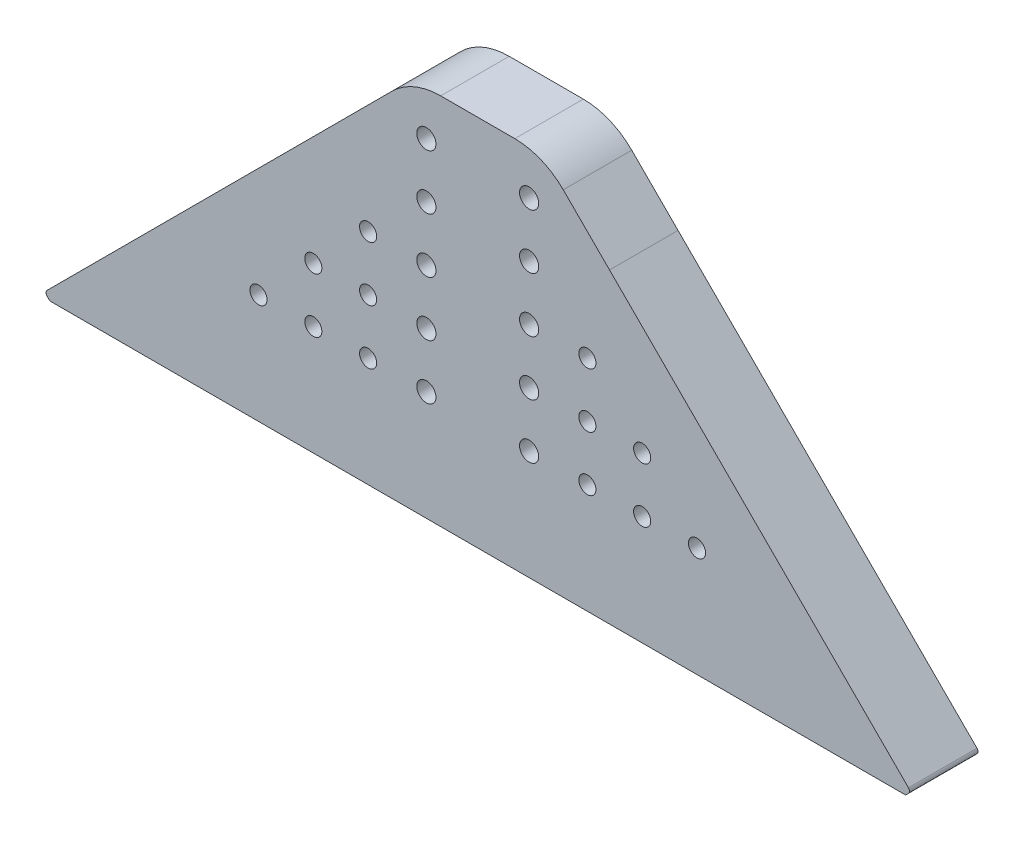
ISO-10303-21;
HEADER;
FILE_DESCRIPTION(('STEP AP214'),'2;1');
FILE_NAME('part.step','',(''),(''),'','','');
FILE_SCHEMA(('AUTOMOTIVE_DESIGN { 1 0 10303 214 1 1 1 1 }'));
ENDSEC;
DATA;
#1=APPLICATION_CONTEXT('core data for automotive mechanical design processes');
#2=APPLICATION_PROTOCOL_DEFINITION('international standard','automotive_design',2000,#1);
#3=PRODUCT_CONTEXT('',#1,'mechanical');
#4=PRODUCT('Part','Part','',(#3));
#5=PRODUCT_RELATED_PRODUCT_CATEGORY('part','',(#4));
#6=PRODUCT_DEFINITION_FORMATION('','',#4);
#7=PRODUCT_DEFINITION_CONTEXT('part definition',#1,'design');
#8=PRODUCT_DEFINITION('design','',#6,#7);
#9=PRODUCT_DEFINITION_SHAPE('','',#8);
#10=(LENGTH_UNIT() NAMED_UNIT(*) SI_UNIT(.MILLI.,.METRE.));
#11=(NAMED_UNIT(*) PLANE_ANGLE_UNIT() SI_UNIT($,.RADIAN.));
#12=(NAMED_UNIT(*) SI_UNIT($,.STERADIAN.) SOLID_ANGLE_UNIT());
#13=UNCERTAINTY_MEASURE_WITH_UNIT(LENGTH_MEASURE(1.E-05),#10,'distance_accuracy_value','');
#14=(GEOMETRIC_REPRESENTATION_CONTEXT(3) GLOBAL_UNCERTAINTY_ASSIGNED_CONTEXT((#13)) GLOBAL_UNIT_ASSIGNED_CONTEXT((#10,
#11,#12)) REPRESENTATION_CONTEXT('',''));
#15=CARTESIAN_POINT('',(0.,0.,0.));
#16=DIRECTION('',(0.,0.,1.));
#17=DIRECTION('',(1.,0.,0.));
#18=AXIS2_PLACEMENT_3D('',#15,#16,#17);
#19=CARTESIAN_POINT('',(1207.69948542874,481.179853247064,10.));
#20=DIRECTION('',(0.,0.,1.));
#21=DIRECTION('',(1.,0.,0.));
#22=AXIS2_PLACEMENT_3D('',#19,#20,#21);
#23=PLANE('',#22);
#24=CARTESIAN_POINT('',(1137.68159220993,528.404852823103,10.));
#25=DIRECTION('',(0.,0.,1.));
#26=DIRECTION('',(1.,0.,0.));
#27=AXIS2_PLACEMENT_3D('',#24,#25,#26);
#28=CIRCLE('',#27,1.40000000000007);
#29=CARTESIAN_POINT('',(1139.08159220993,528.404852823103,10.));
#30=VERTEX_POINT('',#29);
#31=EDGE_CURVE('E355',#30,#30,#28,.T.);
#32=ORIENTED_EDGE('',*,*,#31,.F.);
#33=EDGE_LOOP('',(#32));
#34=FACE_BOUND('',#33,.T.);
#35=CARTESIAN_POINT('',(1137.68159220993,520.404851511801,10.));
#36=DIRECTION('',(0.,0.,1.));
#37=DIRECTION('',(1.,0.,0.));
#38=AXIS2_PLACEMENT_3D('',#35,#36,#37);
#39=CIRCLE('',#38,1.40000000000007);
#40=CARTESIAN_POINT('',(1139.08159220993,520.404851511801,10.));
#41=VERTEX_POINT('',#40);
#42=EDGE_CURVE('E343',#41,#41,#39,.T.);
#43=ORIENTED_EDGE('',*,*,#42,.F.);
#44=EDGE_LOOP('',(#43));
#45=FACE_BOUND('',#44,.T.);
#46=CARTESIAN_POINT('',(1137.68159220993,512.404853925789,10.));
#47=DIRECTION('',(0.,0.,1.));
#48=DIRECTION('',(1.,0.,0.));
#49=AXIS2_PLACEMENT_3D('',#46,#47,#48);
#50=CIRCLE('',#49,1.40000000000007);
#51=CARTESIAN_POINT('',(1139.08159220993,512.404853925789,10.));
#52=VERTEX_POINT('',#51);
#53=EDGE_CURVE('E331',#52,#52,#50,.T.);
#54=ORIENTED_EDGE('',*,*,#53,.F.);
#55=EDGE_LOOP('',(#54));
#56=FACE_BOUND('',#55,.T.);
#57=CARTESIAN_POINT('',(1137.68159220993,504.404852614487,10.));
#58=DIRECTION('',(0.,0.,1.));
#59=DIRECTION('',(1.,0.,0.));
#60=AXIS2_PLACEMENT_3D('',#57,#58,#59);
#61=CIRCLE('',#60,1.40000000000007);
#62=CARTESIAN_POINT('',(1139.08159220993,504.404852614487,10.));
#63=VERTEX_POINT('',#62);
#64=EDGE_CURVE('E319',#63,#63,#61,.T.);
#65=ORIENTED_EDGE('',*,*,#64,.F.);
#66=EDGE_LOOP('',(#65));
#67=FACE_BOUND('',#66,.T.);
#68=CARTESIAN_POINT('',(1137.68159220993,496.40485316583,10.));
#69=DIRECTION('',(0.,0.,1.));
#70=DIRECTION('',(1.,0.,0.));
#71=AXIS2_PLACEMENT_3D('',#68,#69,#70);
#72=CIRCLE('',#71,1.40000000000007);
#73=CARTESIAN_POINT('',(1139.08159220993,496.40485316583,10.));
#74=VERTEX_POINT('',#73);
#75=EDGE_CURVE('E307',#74,#74,#72,.T.);
#76=ORIENTED_EDGE('',*,*,#75,.F.);
#77=EDGE_LOOP('',(#76));
#78=FACE_BOUND('',#77,.T.);
#79=CARTESIAN_POINT('',(1169.18159220993,496.404853247064,10.));
#80=DIRECTION('',(0.,0.,1.));
#81=DIRECTION('',(1.,0.,0.));
#82=AXIS2_PLACEMENT_3D('',#79,#80,#81);
#83=CIRCLE('',#82,1.24999999999997);
#84=CARTESIAN_POINT('',(1170.43159220993,496.404853247064,10.));
#85=VERTEX_POINT('',#84);
#86=EDGE_CURVE('E295',#85,#85,#83,.T.);
#87=ORIENTED_EDGE('',*,*,#86,.F.);
#88=EDGE_LOOP('',(#87));
#89=FACE_BOUND('',#88,.T.);
#90=CARTESIAN_POINT('',(1161.18159220993,504.404853247064,10.));
#91=DIRECTION('',(0.,0.,1.));
#92=DIRECTION('',(1.,0.,0.));
#93=AXIS2_PLACEMENT_3D('',#90,#91,#92);
#94=CIRCLE('',#93,1.24999999999997);
#95=CARTESIAN_POINT('',(1162.43159220993,504.404853247064,10.));
#96=VERTEX_POINT('',#95);
#97=EDGE_CURVE('E283',#96,#96,#94,.T.);
#98=ORIENTED_EDGE('',*,*,#97,.F.);
#99=EDGE_LOOP('',(#98));
#100=FACE_BOUND('',#99,.T.);
#101=CARTESIAN_POINT('',(1169.18159220993,504.404853247064,10.));
#102=DIRECTION('',(0.,0.,1.));
#103=DIRECTION('',(1.,0.,0.));
#104=AXIS2_PLACEMENT_3D('',#101,#102,#103);
#105=CIRCLE('',#104,1.24999999999997);
#106=CARTESIAN_POINT('',(1170.43159220993,504.404853247064,10.));
#107=VERTEX_POINT('',#106);
#108=EDGE_CURVE('E271',#107,#107,#105,.T.);
#109=ORIENTED_EDGE('',*,*,#108,.F.);
#110=EDGE_LOOP('',(#109));
#111=FACE_BOUND('',#110,.T.);
#112=CARTESIAN_POINT('',(1129.18159220993,496.404853247064,10.));
#113=DIRECTION('',(0.,0.,1.));
#114=DIRECTION('',(1.,0.,0.));
#115=AXIS2_PLACEMENT_3D('',#112,#113,#114);
#116=CIRCLE('',#115,1.24999999999997);
#117=CARTESIAN_POINT('',(1130.43159220993,496.404853247064,10.));
#118=VERTEX_POINT('',#117);
#119=EDGE_CURVE('E259',#118,#118,#116,.T.);
#120=ORIENTED_EDGE('',*,*,#119,.F.);
#121=EDGE_LOOP('',(#120));
#122=FACE_BOUND('',#121,.T.);
#123=CARTESIAN_POINT('',(1129.18159220993,512.404853247064,10.));
#124=DIRECTION('',(0.,0.,1.));
#125=DIRECTION('',(1.,0.,0.));
#126=AXIS2_PLACEMENT_3D('',#123,#124,#125);
#127=CIRCLE('',#126,1.24999999999997);
#128=CARTESIAN_POINT('',(1130.43159220993,512.404853247064,10.));
#129=VERTEX_POINT('',#128);
#130=EDGE_CURVE('E247',#129,#129,#127,.T.);
#131=ORIENTED_EDGE('',*,*,#130,.F.);
#132=EDGE_LOOP('',(#131));
#133=FACE_BOUND('',#132,.T.);
#134=CARTESIAN_POINT('',(1113.18159220993,496.404853247064,10.));
#135=DIRECTION('',(0.,0.,1.));
#136=DIRECTION('',(1.,0.,0.));
#137=AXIS2_PLACEMENT_3D('',#134,#135,#136);
#138=CIRCLE('',#137,1.24999999999997);
#139=CARTESIAN_POINT('',(1114.43159220993,496.404853247064,10.));
#140=VERTEX_POINT('',#139);
#141=EDGE_CURVE('E157',#140,#140,#138,.T.);
#142=ORIENTED_EDGE('',*,*,#141,.F.);
#143=EDGE_LOOP('',(#142));
#144=FACE_BOUND('',#143,.T.);
#145=DIRECTION('',(1.,0.,0.));
#146=VECTOR('',#145,1.);
#147=CARTESIAN_POINT('',(1203.23159256011,480.404853326548,10.));
#148=LINE('',#147,#146);
#149=CARTESIAN_POINT('',(1082.73159236639,480.404853326548,10.));
#150=VERTEX_POINT('',#149);
#151=CARTESIAN_POINT('',(1207.63159253626,480.404853326548,10.));
#152=VERTEX_POINT('',#151);
#153=EDGE_CURVE('E52',#150,#152,#148,.T.);
#154=ORIENTED_EDGE('',*,*,#153,.T.);
#155=DIRECTION('',(0.707106574100518,0.707106988272516,0.));
#156=VECTOR('',#155,1.);
#157=CARTESIAN_POINT('',(1207.63159253626,480.404853326548,10.));
#158=LINE('',#157,#156);
#159=CARTESIAN_POINT('',(1208.05303881933,480.82629985647,10.));
#160=VERTEX_POINT('',#159);
#161=EDGE_CURVE('E105',#152,#160,#158,.T.);
#162=ORIENTED_EDGE('',*,*,#161,.T.);
#163=CARTESIAN_POINT('',(1207.69948542874,481.179853247064,10.));
#164=DIRECTION('',(0.,0.,1.));
#165=DIRECTION('',(1.,0.,0.));
#166=AXIS2_PLACEMENT_3D('',#163,#164,#165);
#167=CIRCLE('',#166,0.500000000000057);
#168=CARTESIAN_POINT('',(1208.05303881933,481.533406637657,10.));
#169=VERTEX_POINT('',#168);
#170=EDGE_CURVE('E197',#160,#169,#167,.T.);
#171=ORIENTED_EDGE('',*,*,#170,.T.);
#172=DIRECTION('',(-0.707106761502169,0.707106800870926,0.));
#173=VECTOR('',#172,1.);
#174=CARTESIAN_POINT('',(1208.05303881933,481.533406637657,10.));
#175=LINE('',#174,#173);
#176=CARTESIAN_POINT('',(1164.41831634372,525.168131542672,10.));
#177=VERTEX_POINT('',#176);
#178=EDGE_CURVE('E217',#169,#177,#175,.T.);
#179=ORIENTED_EDGE('',*,*,#178,.T.);
#180=DIRECTION('',(-0.707106853921102,0.707106708451985,0.));
#181=VECTOR('',#180,1.);
#182=CARTESIAN_POINT('',(1164.41831634372,525.168131542672,10.));
#183=LINE('',#182,#181);
#184=CARTESIAN_POINT('',(1157.66052306279,531.925923433361,10.));
#185=VERTEX_POINT('',#184);
#186=EDGE_CURVE('E214',#177,#185,#183,.T.);
#187=ORIENTED_EDGE('',*,*,#186,.T.);
#188=CARTESIAN_POINT('',(1150.58945597827,524.85485489415,10.));
#189=DIRECTION('',(0.,0.,1.));
#190=DIRECTION('',(1.,0.,0.));
#191=AXIS2_PLACEMENT_3D('',#188,#189,#190);
#192=CIRCLE('',#191,10.0000000000001);
#193=CARTESIAN_POINT('',(1150.58945597827,534.85485489415,10.));
#194=VERTEX_POINT('',#193);
#195=EDGE_CURVE('E216',#185,#194,#192,.T.);
#196=ORIENTED_EDGE('',*,*,#195,.T.);
#197=DIRECTION('',(-1.,0.,0.));
#198=VECTOR('',#197,1.);
#199=CARTESIAN_POINT('',(1150.58945597827,534.85485489415,10.));
#200=LINE('',#199,#198);
#201=CARTESIAN_POINT('',(1139.77372941223,534.85485489415,10.));
#202=VERTEX_POINT('',#201);
#203=EDGE_CURVE('E219',#194,#202,#200,.T.);
#204=ORIENTED_EDGE('',*,*,#203,.T.);
#205=CARTESIAN_POINT('',(1139.77372941222,524.85485489415,10.));
#206=DIRECTION('',(0.,0.,1.));
#207=DIRECTION('',(1.,0.,0.));
#208=AXIS2_PLACEMENT_3D('',#205,#206,#207);
#209=CIRCLE('',#208,9.99999999999995);
#210=CARTESIAN_POINT('',(1132.70266159555,531.925922701208,10.));
#211=VERTEX_POINT('',#210);
#212=EDGE_CURVE('E134',#202,#211,#209,.T.);
#213=ORIENTED_EDGE('',*,*,#212,.T.);
#214=DIRECTION('',(-0.707106780705817,-0.707106781667278,0.));
#215=VECTOR('',#214,1.);
#216=CARTESIAN_POINT('',(1082.31014560052,481.533406637657,10.));
#217=LINE('',#216,#215);
#218=CARTESIAN_POINT('',(1082.31014496101,481.533407277163,10.));
#219=VERTEX_POINT('',#218);
#220=EDGE_CURVE('E128',#211,#219,#217,.T.);
#221=ORIENTED_EDGE('',*,*,#220,.T.);
#222=CARTESIAN_POINT('',(1082.66369899111,481.179853247064,10.));
#223=DIRECTION('',(0.,0.,1.));
#224=DIRECTION('',(1.,0.,0.));
#225=AXIS2_PLACEMENT_3D('',#222,#223,#224);
#226=CIRCLE('',#225,0.500000904398596);
#227=CARTESIAN_POINT('',(1082.31014282434,480.826300074626,10.));
#228=VERTEX_POINT('',#227);
#229=EDGE_CURVE('E132',#219,#228,#226,.T.);
#230=ORIENTED_EDGE('',*,*,#229,.T.);
#231=DIRECTION('',(0.707109125046057,-0.707104437319269,0.));
#232=VECTOR('',#231,1.);
#233=CARTESIAN_POINT('',(1082.73159236639,480.404853326548,10.));
#234=LINE('',#233,#232);
#235=EDGE_CURVE('E148',#228,#150,#234,.T.);
#236=ORIENTED_EDGE('',*,*,#235,.T.);
#237=EDGE_LOOP('',(#154,#162,#171,#179,#187,#196,#204,#213,#221,#230,#236));
#238=FACE_BOUND('',#237,.T.);
#239=CARTESIAN_POINT('',(1121.18159220993,496.404853247064,10.));
#240=DIRECTION('',(0.,0.,1.));
#241=DIRECTION('',(1.,0.,0.));
#242=AXIS2_PLACEMENT_3D('',#239,#240,#241);
#243=CIRCLE('',#242,1.24999999999997);
#244=CARTESIAN_POINT('',(1122.43159220993,496.404853247064,10.));
#245=VERTEX_POINT('',#244);
#246=EDGE_CURVE('E241',#245,#245,#243,.T.);
#247=ORIENTED_EDGE('',*,*,#246,.F.);
#248=EDGE_LOOP('',(#247));
#249=FACE_BOUND('',#248,.T.);
#250=CARTESIAN_POINT('',(1129.18159220993,504.404853247064,10.));
#251=DIRECTION('',(0.,0.,1.));
#252=DIRECTION('',(1.,0.,0.));
#253=AXIS2_PLACEMENT_3D('',#250,#251,#252);
#254=CIRCLE('',#253,1.24999999999997);
#255=CARTESIAN_POINT('',(1130.43159220993,504.404853247064,10.));
#256=VERTEX_POINT('',#255);
#257=EDGE_CURVE('E253',#256,#256,#254,.T.);
#258=ORIENTED_EDGE('',*,*,#257,.F.);
#259=EDGE_LOOP('',(#258));
#260=FACE_BOUND('',#259,.T.);
#261=CARTESIAN_POINT('',(1121.18159220993,504.404853247064,10.));
#262=DIRECTION('',(0.,0.,1.));
#263=DIRECTION('',(1.,0.,0.));
#264=AXIS2_PLACEMENT_3D('',#261,#262,#263);
#265=CIRCLE('',#264,1.24999999999997);
#266=CARTESIAN_POINT('',(1122.43159220993,504.404853247064,10.));
#267=VERTEX_POINT('',#266);
#268=EDGE_CURVE('E265',#267,#267,#265,.T.);
#269=ORIENTED_EDGE('',*,*,#268,.F.);
#270=EDGE_LOOP('',(#269));
#271=FACE_BOUND('',#270,.T.);
#272=CARTESIAN_POINT('',(1161.18159220993,496.404853247064,10.));
#273=DIRECTION('',(0.,0.,1.));
#274=DIRECTION('',(1.,0.,0.));
#275=AXIS2_PLACEMENT_3D('',#272,#273,#274);
#276=CIRCLE('',#275,1.24999999999997);
#277=CARTESIAN_POINT('',(1162.43159220993,496.404853247064,10.));
#278=VERTEX_POINT('',#277);
#279=EDGE_CURVE('E277',#278,#278,#276,.T.);
#280=ORIENTED_EDGE('',*,*,#279,.F.);
#281=EDGE_LOOP('',(#280));
#282=FACE_BOUND('',#281,.T.);
#283=CARTESIAN_POINT('',(1161.18159220993,512.404853247064,10.));
#284=DIRECTION('',(0.,0.,1.));
#285=DIRECTION('',(1.,0.,0.));
#286=AXIS2_PLACEMENT_3D('',#283,#284,#285);
#287=CIRCLE('',#286,1.24999999999997);
#288=CARTESIAN_POINT('',(1162.43159220993,512.404853247064,10.));
#289=VERTEX_POINT('',#288);
#290=EDGE_CURVE('E289',#289,#289,#287,.T.);
#291=ORIENTED_EDGE('',*,*,#290,.F.);
#292=EDGE_LOOP('',(#291));
#293=FACE_BOUND('',#292,.T.);
#294=CARTESIAN_POINT('',(1177.18159220993,496.404853247064,10.));
#295=DIRECTION('',(0.,0.,1.));
#296=DIRECTION('',(1.,0.,0.));
#297=AXIS2_PLACEMENT_3D('',#294,#295,#296);
#298=CIRCLE('',#297,1.24999999999997);
#299=CARTESIAN_POINT('',(1178.43159220993,496.404853247064,10.));
#300=VERTEX_POINT('',#299);
#301=EDGE_CURVE('E301',#300,#300,#298,.T.);
#302=ORIENTED_EDGE('',*,*,#301,.F.);
#303=EDGE_LOOP('',(#302));
#304=FACE_BOUND('',#303,.T.);
#305=CARTESIAN_POINT('',(1152.68159220993,496.40485316583,10.));
#306=DIRECTION('',(0.,0.,1.));
#307=DIRECTION('',(1.,0.,0.));
#308=AXIS2_PLACEMENT_3D('',#305,#306,#307);
#309=CIRCLE('',#308,1.40000000000007);
#310=CARTESIAN_POINT('',(1154.08159220993,496.40485316583,10.));
#311=VERTEX_POINT('',#310);
#312=EDGE_CURVE('E313',#311,#311,#309,.T.);
#313=ORIENTED_EDGE('',*,*,#312,.F.);
#314=EDGE_LOOP('',(#313));
#315=FACE_BOUND('',#314,.T.);
#316=CARTESIAN_POINT('',(1152.68159220993,504.404852614487,10.));
#317=DIRECTION('',(0.,0.,1.));
#318=DIRECTION('',(1.,0.,0.));
#319=AXIS2_PLACEMENT_3D('',#316,#317,#318);
#320=CIRCLE('',#319,1.40000000000007);
#321=CARTESIAN_POINT('',(1154.08159220993,504.404852614487,10.));
#322=VERTEX_POINT('',#321);
#323=EDGE_CURVE('E325',#322,#322,#320,.T.);
#324=ORIENTED_EDGE('',*,*,#323,.F.);
#325=EDGE_LOOP('',(#324));
#326=FACE_BOUND('',#325,.T.);
#327=CARTESIAN_POINT('',(1152.68159220993,512.404853925789,10.));
#328=DIRECTION('',(0.,0.,1.));
#329=DIRECTION('',(1.,0.,0.));
#330=AXIS2_PLACEMENT_3D('',#327,#328,#329);
#331=CIRCLE('',#330,1.40000000000007);
#332=CARTESIAN_POINT('',(1154.08159220993,512.404853925789,10.));
#333=VERTEX_POINT('',#332);
#334=EDGE_CURVE('E337',#333,#333,#331,.T.);
#335=ORIENTED_EDGE('',*,*,#334,.F.);
#336=EDGE_LOOP('',(#335));
#337=FACE_BOUND('',#336,.T.);
#338=CARTESIAN_POINT('',(1152.68159220993,520.404851511801,10.));
#339=DIRECTION('',(0.,0.,1.));
#340=DIRECTION('',(1.,0.,0.));
#341=AXIS2_PLACEMENT_3D('',#338,#339,#340);
#342=CIRCLE('',#341,1.40000000000007);
#343=CARTESIAN_POINT('',(1154.08159220993,520.404851511801,10.));
#344=VERTEX_POINT('',#343);
#345=EDGE_CURVE('E349',#344,#344,#342,.T.);
#346=ORIENTED_EDGE('',*,*,#345,.F.);
#347=EDGE_LOOP('',(#346));
#348=FACE_BOUND('',#347,.T.);
#349=CARTESIAN_POINT('',(1152.68159220993,528.404852823103,10.));
#350=DIRECTION('',(0.,0.,1.));
#351=DIRECTION('',(1.,0.,0.));
#352=AXIS2_PLACEMENT_3D('',#349,#350,#351);
#353=CIRCLE('',#352,1.40000000000007);
#354=CARTESIAN_POINT('',(1154.08159220993,528.404852823103,10.));
#355=VERTEX_POINT('',#354);
#356=EDGE_CURVE('E361',#355,#355,#353,.T.);
#357=ORIENTED_EDGE('',*,*,#356,.F.);
#358=EDGE_LOOP('',(#357));
#359=FACE_BOUND('',#358,.T.);
#360=ADVANCED_FACE('F35',(#34,#45,#56,#67,#78,#89,#100,#111,#122,#133,#144,#238,#249,#260,#271,
#282,#293,#304,#315,#326,#337,#348,#359),#23,.T.);
#361=CARTESIAN_POINT('',(1207.69948542874,481.179853247064,0.));
#362=DIRECTION('',(0.,0.,1.));
#363=DIRECTION('',(1.,0.,0.));
#364=AXIS2_PLACEMENT_3D('',#361,#362,#363);
#365=PLANE('',#364);
#366=DIRECTION('',(0.707106574100518,0.707106988272516,0.));
#367=VECTOR('',#366,1.);
#368=CARTESIAN_POINT('',(1207.63159253626,480.404853326548,0.));
#369=LINE('',#368,#367);
#370=CARTESIAN_POINT('',(1207.63159253626,480.404853326548,0.));
#371=VERTEX_POINT('',#370);
#372=CARTESIAN_POINT('',(1208.05303881933,480.82629985647,0.));
#373=VERTEX_POINT('',#372);
#374=EDGE_CURVE('E154',#371,#373,#369,.T.);
#375=ORIENTED_EDGE('',*,*,#374,.F.);
#376=DIRECTION('',(1.,0.,0.));
#377=VECTOR('',#376,1.);
#378=CARTESIAN_POINT('',(1203.23159256011,480.404853326548,0.));
#379=LINE('',#378,#377);
#380=CARTESIAN_POINT('',(1082.73159236639,480.404853326548,0.));
#381=VERTEX_POINT('',#380);
#382=EDGE_CURVE('E172',#381,#371,#379,.T.);
#383=ORIENTED_EDGE('',*,*,#382,.F.);
#384=DIRECTION('',(0.707109125046057,-0.707104437319269,0.));
#385=VECTOR('',#384,1.);
#386=CARTESIAN_POINT('',(1082.73159236639,480.404853326548,0.));
#387=LINE('',#386,#385);
#388=CARTESIAN_POINT('',(1082.31014282434,480.826300074626,0.));
#389=VERTEX_POINT('',#388);
#390=EDGE_CURVE('E98',#389,#381,#387,.T.);
#391=ORIENTED_EDGE('',*,*,#390,.F.);
#392=CARTESIAN_POINT('',(1082.66369899111,481.179853247064,0.));
#393=DIRECTION('',(0.,0.,1.));
#394=DIRECTION('',(1.,0.,0.));
#395=AXIS2_PLACEMENT_3D('',#392,#393,#394);
#396=CIRCLE('',#395,0.500000904398596);
#397=CARTESIAN_POINT('',(1082.31014496101,481.533407277163,0.));
#398=VERTEX_POINT('',#397);
#399=EDGE_CURVE('E91',#398,#389,#396,.T.);
#400=ORIENTED_EDGE('',*,*,#399,.F.);
#401=DIRECTION('',(-0.707106780705817,-0.707106781667278,0.));
#402=VECTOR('',#401,1.);
#403=CARTESIAN_POINT('',(1082.31014560052,481.533406637657,0.));
#404=LINE('',#403,#402);
#405=CARTESIAN_POINT('',(1132.70266159555,531.925922701208,0.));
#406=VERTEX_POINT('',#405);
#407=EDGE_CURVE('E142',#406,#398,#404,.T.);
#408=ORIENTED_EDGE('',*,*,#407,.F.);
#409=CARTESIAN_POINT('',(1139.77372941222,524.85485489415,0.));
#410=DIRECTION('',(0.,0.,1.));
#411=DIRECTION('',(1.,0.,0.));
#412=AXIS2_PLACEMENT_3D('',#409,#410,#411);
#413=CIRCLE('',#412,9.99999999999995);
#414=CARTESIAN_POINT('',(1139.77372941223,534.85485489415,0.));
#415=VERTEX_POINT('',#414);
#416=EDGE_CURVE('E167',#415,#406,#413,.T.);
#417=ORIENTED_EDGE('',*,*,#416,.F.);
#418=DIRECTION('',(-1.,0.,0.));
#419=VECTOR('',#418,1.);
#420=CARTESIAN_POINT('',(1150.58945597827,534.85485489415,0.));
#421=LINE('',#420,#419);
#422=CARTESIAN_POINT('',(1150.58945597827,534.85485489415,0.));
#423=VERTEX_POINT('',#422);
#424=EDGE_CURVE('E165',#423,#415,#421,.T.);
#425=ORIENTED_EDGE('',*,*,#424,.F.);
#426=CARTESIAN_POINT('',(1150.58945597827,524.85485489415,0.));
#427=DIRECTION('',(0.,0.,1.));
#428=DIRECTION('',(1.,0.,0.));
#429=AXIS2_PLACEMENT_3D('',#426,#427,#428);
#430=CIRCLE('',#429,10.0000000000001);
#431=CARTESIAN_POINT('',(1157.66052306279,531.925923433361,0.));
#432=VERTEX_POINT('',#431);
#433=EDGE_CURVE('E163',#432,#423,#430,.T.);
#434=ORIENTED_EDGE('',*,*,#433,.F.);
#435=DIRECTION('',(-0.707106853921102,0.707106708451985,0.));
#436=VECTOR('',#435,1.);
#437=CARTESIAN_POINT('',(1164.41831634372,525.168131542672,0.));
#438=LINE('',#437,#436);
#439=CARTESIAN_POINT('',(1164.41831634372,525.168131542672,0.));
#440=VERTEX_POINT('',#439);
#441=EDGE_CURVE('E161',#440,#432,#438,.T.);
#442=ORIENTED_EDGE('',*,*,#441,.F.);
#443=DIRECTION('',(-0.707106761502169,0.707106800870926,0.));
#444=VECTOR('',#443,1.);
#445=CARTESIAN_POINT('',(1208.05303881933,481.533406637657,0.));
#446=LINE('',#445,#444);
#447=CARTESIAN_POINT('',(1208.05303881933,481.533406637657,0.));
#448=VERTEX_POINT('',#447);
#449=EDGE_CURVE('E159',#448,#440,#446,.T.);
#450=ORIENTED_EDGE('',*,*,#449,.F.);
#451=CARTESIAN_POINT('',(1207.69948542874,481.179853247064,0.));
#452=DIRECTION('',(0.,0.,1.));
#453=DIRECTION('',(1.,0.,0.));
#454=AXIS2_PLACEMENT_3D('',#451,#452,#453);
#455=CIRCLE('',#454,0.500000000000057);
#456=EDGE_CURVE('E156',#373,#448,#455,.T.);
#457=ORIENTED_EDGE('',*,*,#456,.F.);
#458=EDGE_LOOP('',(#375,#383,#391,#400,#408,#417,#425,#434,#442,#450,#457));
#459=FACE_BOUND('',#458,.T.);
#460=CARTESIAN_POINT('',(1113.18159220993,496.404853247064,0.));
#461=DIRECTION('',(0.,0.,1.));
#462=DIRECTION('',(1.,0.,0.));
#463=AXIS2_PLACEMENT_3D('',#460,#461,#462);
#464=CIRCLE('',#463,1.24999999999997);
#465=CARTESIAN_POINT('',(1114.43159220993,496.404853247064,0.));
#466=VERTEX_POINT('',#465);
#467=EDGE_CURVE('E238',#466,#466,#464,.T.);
#468=ORIENTED_EDGE('',*,*,#467,.T.);
#469=EDGE_LOOP('',(#468));
#470=FACE_BOUND('',#469,.T.);
#471=CARTESIAN_POINT('',(1121.18159220993,496.404853247064,0.));
#472=DIRECTION('',(0.,0.,1.));
#473=DIRECTION('',(1.,0.,0.));
#474=AXIS2_PLACEMENT_3D('',#471,#472,#473);
#475=CIRCLE('',#474,1.24999999999997);
#476=CARTESIAN_POINT('',(1122.43159220993,496.404853247064,0.));
#477=VERTEX_POINT('',#476);
#478=EDGE_CURVE('E244',#477,#477,#475,.T.);
#479=ORIENTED_EDGE('',*,*,#478,.T.);
#480=EDGE_LOOP('',(#479));
#481=FACE_BOUND('',#480,.T.);
#482=CARTESIAN_POINT('',(1129.18159220993,512.404853247064,0.));
#483=DIRECTION('',(0.,0.,1.));
#484=DIRECTION('',(1.,0.,0.));
#485=AXIS2_PLACEMENT_3D('',#482,#483,#484);
#486=CIRCLE('',#485,1.24999999999997);
#487=CARTESIAN_POINT('',(1130.43159220993,512.404853247064,0.));
#488=VERTEX_POINT('',#487);
#489=EDGE_CURVE('E250',#488,#488,#486,.T.);
#490=ORIENTED_EDGE('',*,*,#489,.T.);
#491=EDGE_LOOP('',(#490));
#492=FACE_BOUND('',#491,.T.);
#493=CARTESIAN_POINT('',(1129.18159220993,504.404853247064,0.));
#494=DIRECTION('',(0.,0.,1.));
#495=DIRECTION('',(1.,0.,0.));
#496=AXIS2_PLACEMENT_3D('',#493,#494,#495);
#497=CIRCLE('',#496,1.24999999999997);
#498=CARTESIAN_POINT('',(1130.43159220993,504.404853247064,0.));
#499=VERTEX_POINT('',#498);
#500=EDGE_CURVE('E256',#499,#499,#497,.T.);
#501=ORIENTED_EDGE('',*,*,#500,.T.);
#502=EDGE_LOOP('',(#501));
#503=FACE_BOUND('',#502,.T.);
#504=CARTESIAN_POINT('',(1129.18159220993,496.404853247064,0.));
#505=DIRECTION('',(0.,0.,1.));
#506=DIRECTION('',(1.,0.,0.));
#507=AXIS2_PLACEMENT_3D('',#504,#505,#506);
#508=CIRCLE('',#507,1.24999999999997);
#509=CARTESIAN_POINT('',(1130.43159220993,496.404853247064,0.));
#510=VERTEX_POINT('',#509);
#511=EDGE_CURVE('E262',#510,#510,#508,.T.);
#512=ORIENTED_EDGE('',*,*,#511,.T.);
#513=EDGE_LOOP('',(#512));
#514=FACE_BOUND('',#513,.T.);
#515=CARTESIAN_POINT('',(1121.18159220993,504.404853247064,0.));
#516=DIRECTION('',(0.,0.,1.));
#517=DIRECTION('',(1.,0.,0.));
#518=AXIS2_PLACEMENT_3D('',#515,#516,#517);
#519=CIRCLE('',#518,1.24999999999997);
#520=CARTESIAN_POINT('',(1122.43159220993,504.404853247064,0.));
#521=VERTEX_POINT('',#520);
#522=EDGE_CURVE('E268',#521,#521,#519,.T.);
#523=ORIENTED_EDGE('',*,*,#522,.T.);
#524=EDGE_LOOP('',(#523));
#525=FACE_BOUND('',#524,.T.);
#526=CARTESIAN_POINT('',(1169.18159220993,504.404853247064,0.));
#527=DIRECTION('',(0.,0.,1.));
#528=DIRECTION('',(1.,0.,0.));
#529=AXIS2_PLACEMENT_3D('',#526,#527,#528);
#530=CIRCLE('',#529,1.24999999999997);
#531=CARTESIAN_POINT('',(1170.43159220993,504.404853247064,0.));
#532=VERTEX_POINT('',#531);
#533=EDGE_CURVE('E274',#532,#532,#530,.T.);
#534=ORIENTED_EDGE('',*,*,#533,.T.);
#535=EDGE_LOOP('',(#534));
#536=FACE_BOUND('',#535,.T.);
#537=CARTESIAN_POINT('',(1161.18159220993,496.404853247064,0.));
#538=DIRECTION('',(0.,0.,1.));
#539=DIRECTION('',(1.,0.,0.));
#540=AXIS2_PLACEMENT_3D('',#537,#538,#539);
#541=CIRCLE('',#540,1.24999999999997);
#542=CARTESIAN_POINT('',(1162.43159220993,496.404853247064,0.));
#543=VERTEX_POINT('',#542);
#544=EDGE_CURVE('E280',#543,#543,#541,.T.);
#545=ORIENTED_EDGE('',*,*,#544,.T.);
#546=EDGE_LOOP('',(#545));
#547=FACE_BOUND('',#546,.T.);
#548=CARTESIAN_POINT('',(1161.18159220993,504.404853247064,0.));
#549=DIRECTION('',(0.,0.,1.));
#550=DIRECTION('',(1.,0.,0.));
#551=AXIS2_PLACEMENT_3D('',#548,#549,#550);
#552=CIRCLE('',#551,1.24999999999997);
#553=CARTESIAN_POINT('',(1162.43159220993,504.404853247064,0.));
#554=VERTEX_POINT('',#553);
#555=EDGE_CURVE('E286',#554,#554,#552,.T.);
#556=ORIENTED_EDGE('',*,*,#555,.T.);
#557=EDGE_LOOP('',(#556));
#558=FACE_BOUND('',#557,.T.);
#559=CARTESIAN_POINT('',(1161.18159220993,512.404853247064,0.));
#560=DIRECTION('',(0.,0.,1.));
#561=DIRECTION('',(1.,0.,0.));
#562=AXIS2_PLACEMENT_3D('',#559,#560,#561);
#563=CIRCLE('',#562,1.24999999999997);
#564=CARTESIAN_POINT('',(1162.43159220993,512.404853247064,0.));
#565=VERTEX_POINT('',#564);
#566=EDGE_CURVE('E292',#565,#565,#563,.T.);
#567=ORIENTED_EDGE('',*,*,#566,.T.);
#568=EDGE_LOOP('',(#567));
#569=FACE_BOUND('',#568,.T.);
#570=CARTESIAN_POINT('',(1169.18159220993,496.404853247064,0.));
#571=DIRECTION('',(0.,0.,1.));
#572=DIRECTION('',(1.,0.,0.));
#573=AXIS2_PLACEMENT_3D('',#570,#571,#572);
#574=CIRCLE('',#573,1.24999999999997);
#575=CARTESIAN_POINT('',(1170.43159220993,496.404853247064,0.));
#576=VERTEX_POINT('',#575);
#577=EDGE_CURVE('E298',#576,#576,#574,.T.);
#578=ORIENTED_EDGE('',*,*,#577,.T.);
#579=EDGE_LOOP('',(#578));
#580=FACE_BOUND('',#579,.T.);
#581=CARTESIAN_POINT('',(1177.18159220993,496.404853247064,0.));
#582=DIRECTION('',(0.,0.,1.));
#583=DIRECTION('',(1.,0.,0.));
#584=AXIS2_PLACEMENT_3D('',#581,#582,#583);
#585=CIRCLE('',#584,1.24999999999997);
#586=CARTESIAN_POINT('',(1178.43159220993,496.404853247064,0.));
#587=VERTEX_POINT('',#586);
#588=EDGE_CURVE('E304',#587,#587,#585,.T.);
#589=ORIENTED_EDGE('',*,*,#588,.T.);
#590=EDGE_LOOP('',(#589));
#591=FACE_BOUND('',#590,.T.);
#592=CARTESIAN_POINT('',(1137.68159220993,496.40485316583,0.));
#593=DIRECTION('',(0.,0.,1.));
#594=DIRECTION('',(1.,0.,0.));
#595=AXIS2_PLACEMENT_3D('',#592,#593,#594);
#596=CIRCLE('',#595,1.40000000000007);
#597=CARTESIAN_POINT('',(1139.08159220993,496.40485316583,0.));
#598=VERTEX_POINT('',#597);
#599=EDGE_CURVE('E310',#598,#598,#596,.T.);
#600=ORIENTED_EDGE('',*,*,#599,.T.);
#601=EDGE_LOOP('',(#600));
#602=FACE_BOUND('',#601,.T.);
#603=CARTESIAN_POINT('',(1152.68159220993,496.40485316583,0.));
#604=DIRECTION('',(0.,0.,1.));
#605=DIRECTION('',(1.,0.,0.));
#606=AXIS2_PLACEMENT_3D('',#603,#604,#605);
#607=CIRCLE('',#606,1.40000000000007);
#608=CARTESIAN_POINT('',(1154.08159220993,496.40485316583,0.));
#609=VERTEX_POINT('',#608);
#610=EDGE_CURVE('E316',#609,#609,#607,.T.);
#611=ORIENTED_EDGE('',*,*,#610,.T.);
#612=EDGE_LOOP('',(#611));
#613=FACE_BOUND('',#612,.T.);
#614=CARTESIAN_POINT('',(1137.68159220993,504.404852614487,0.));
#615=DIRECTION('',(0.,0.,1.));
#616=DIRECTION('',(1.,0.,0.));
#617=AXIS2_PLACEMENT_3D('',#614,#615,#616);
#618=CIRCLE('',#617,1.40000000000007);
#619=CARTESIAN_POINT('',(1139.08159220993,504.404852614487,0.));
#620=VERTEX_POINT('',#619);
#621=EDGE_CURVE('E322',#620,#620,#618,.T.);
#622=ORIENTED_EDGE('',*,*,#621,.T.);
#623=EDGE_LOOP('',(#622));
#624=FACE_BOUND('',#623,.T.);
#625=CARTESIAN_POINT('',(1152.68159220993,504.404852614487,0.));
#626=DIRECTION('',(0.,0.,1.));
#627=DIRECTION('',(1.,0.,0.));
#628=AXIS2_PLACEMENT_3D('',#625,#626,#627);
#629=CIRCLE('',#628,1.40000000000007);
#630=CARTESIAN_POINT('',(1154.08159220993,504.404852614487,0.));
#631=VERTEX_POINT('',#630);
#632=EDGE_CURVE('E328',#631,#631,#629,.T.);
#633=ORIENTED_EDGE('',*,*,#632,.T.);
#634=EDGE_LOOP('',(#633));
#635=FACE_BOUND('',#634,.T.);
#636=CARTESIAN_POINT('',(1137.68159220993,512.404853925789,0.));
#637=DIRECTION('',(0.,0.,1.));
#638=DIRECTION('',(1.,0.,0.));
#639=AXIS2_PLACEMENT_3D('',#636,#637,#638);
#640=CIRCLE('',#639,1.40000000000007);
#641=CARTESIAN_POINT('',(1139.08159220993,512.404853925789,0.));
#642=VERTEX_POINT('',#641);
#643=EDGE_CURVE('E334',#642,#642,#640,.T.);
#644=ORIENTED_EDGE('',*,*,#643,.T.);
#645=EDGE_LOOP('',(#644));
#646=FACE_BOUND('',#645,.T.);
#647=CARTESIAN_POINT('',(1152.68159220993,512.404853925789,0.));
#648=DIRECTION('',(0.,0.,1.));
#649=DIRECTION('',(1.,0.,0.));
#650=AXIS2_PLACEMENT_3D('',#647,#648,#649);
#651=CIRCLE('',#650,1.40000000000007);
#652=CARTESIAN_POINT('',(1154.08159220993,512.404853925789,0.));
#653=VERTEX_POINT('',#652);
#654=EDGE_CURVE('E340',#653,#653,#651,.T.);
#655=ORIENTED_EDGE('',*,*,#654,.T.);
#656=EDGE_LOOP('',(#655));
#657=FACE_BOUND('',#656,.T.);
#658=CARTESIAN_POINT('',(1137.68159220993,520.404851511801,0.));
#659=DIRECTION('',(0.,0.,1.));
#660=DIRECTION('',(1.,0.,0.));
#661=AXIS2_PLACEMENT_3D('',#658,#659,#660);
#662=CIRCLE('',#661,1.40000000000007);
#663=CARTESIAN_POINT('',(1139.08159220993,520.404851511801,0.));
#664=VERTEX_POINT('',#663);
#665=EDGE_CURVE('E346',#664,#664,#662,.T.);
#666=ORIENTED_EDGE('',*,*,#665,.T.);
#667=EDGE_LOOP('',(#666));
#668=FACE_BOUND('',#667,.T.);
#669=CARTESIAN_POINT('',(1152.68159220993,520.404851511801,0.));
#670=DIRECTION('',(0.,0.,1.));
#671=DIRECTION('',(1.,0.,0.));
#672=AXIS2_PLACEMENT_3D('',#669,#670,#671);
#673=CIRCLE('',#672,1.40000000000007);
#674=CARTESIAN_POINT('',(1154.08159220993,520.404851511801,0.));
#675=VERTEX_POINT('',#674);
#676=EDGE_CURVE('E352',#675,#675,#673,.T.);
#677=ORIENTED_EDGE('',*,*,#676,.T.);
#678=EDGE_LOOP('',(#677));
#679=FACE_BOUND('',#678,.T.);
#680=CARTESIAN_POINT('',(1137.68159220993,528.404852823103,0.));
#681=DIRECTION('',(0.,0.,1.));
#682=DIRECTION('',(1.,0.,0.));
#683=AXIS2_PLACEMENT_3D('',#680,#681,#682);
#684=CIRCLE('',#683,1.40000000000007);
#685=CARTESIAN_POINT('',(1139.08159220993,528.404852823103,0.));
#686=VERTEX_POINT('',#685);
#687=EDGE_CURVE('E358',#686,#686,#684,.T.);
#688=ORIENTED_EDGE('',*,*,#687,.T.);
#689=EDGE_LOOP('',(#688));
#690=FACE_BOUND('',#689,.T.);
#691=CARTESIAN_POINT('',(1152.68159220993,528.404852823103,0.));
#692=DIRECTION('',(0.,0.,1.));
#693=DIRECTION('',(1.,0.,0.));
#694=AXIS2_PLACEMENT_3D('',#691,#692,#693);
#695=CIRCLE('',#694,1.40000000000007);
#696=CARTESIAN_POINT('',(1154.08159220993,528.404852823103,0.));
#697=VERTEX_POINT('',#696);
#698=EDGE_CURVE('E364',#697,#697,#695,.T.);
#699=ORIENTED_EDGE('',*,*,#698,.T.);
#700=EDGE_LOOP('',(#699));
#701=FACE_BOUND('',#700,.T.);
#702=ADVANCED_FACE('F201',(#459,#470,#481,#492,#503,#514,#525,#536,#547,#558,#569,#580,#591,
#602,#613,#624,#635,#646,#657,#668,#679,#690,#701),#365,.F.);
#703=CARTESIAN_POINT('',(1207.63159253626,480.404853326548,10.));
#704=DIRECTION('',(-0.707106988272516,0.707106574100518,0.));
#705=DIRECTION('',(-0.707106574100518,-0.707106988272516,0.));
#706=AXIS2_PLACEMENT_3D('',#703,#704,#705);
#707=PLANE('',#706);
#708=ORIENTED_EDGE('',*,*,#374,.T.);
#709=DIRECTION('',(0.,0.,-1.));
#710=VECTOR('',#709,1.);
#711=CARTESIAN_POINT('',(1208.05303881933,480.82629985647,10.));
#712=LINE('',#711,#710);
#713=EDGE_CURVE('E44',#160,#373,#712,.T.);
#714=ORIENTED_EDGE('',*,*,#713,.F.);
#715=ORIENTED_EDGE('',*,*,#161,.F.);
#716=DIRECTION('',(0.,0.,-1.));
#717=VECTOR('',#716,1.);
#718=CARTESIAN_POINT('',(1207.63159253626,480.404853326548,10.));
#719=LINE('',#718,#717);
#720=EDGE_CURVE('E11',#152,#371,#719,.T.);
#721=ORIENTED_EDGE('',*,*,#720,.T.);
#722=EDGE_LOOP('',(#708,#714,#715,#721));
#723=FACE_BOUND('',#722,.T.);
#724=ADVANCED_FACE('F37',(#723),#707,.F.);
#725=CARTESIAN_POINT('',(1207.69948542874,481.179853247064,10.));
#726=DIRECTION('',(0.,0.,-1.));
#727=DIRECTION('',(-1.,0.,0.));
#728=AXIS2_PLACEMENT_3D('',#725,#726,#727);
#729=CYLINDRICAL_SURFACE('',#728,0.500000000000057);
#730=ORIENTED_EDGE('',*,*,#456,.T.);
#731=DIRECTION('',(0.,0.,-1.));
#732=VECTOR('',#731,1.);
#733=CARTESIAN_POINT('',(1208.05303881933,481.533406637657,10.));
#734=LINE('',#733,#732);
#735=EDGE_CURVE('E189',#169,#448,#734,.T.);
#736=ORIENTED_EDGE('',*,*,#735,.F.);
#737=ORIENTED_EDGE('',*,*,#170,.F.);
#738=ORIENTED_EDGE('',*,*,#713,.T.);
#739=EDGE_LOOP('',(#730,#736,#737,#738));
#740=FACE_BOUND('',#739,.T.);
#741=ADVANCED_FACE('F195',(#740),#729,.T.);
#742=CARTESIAN_POINT('',(1208.05303881933,481.533406637657,10.));
#743=DIRECTION('',(-0.707106800870926,-0.707106761502169,0.));
#744=DIRECTION('',(0.707106761502169,-0.707106800870926,0.));
#745=AXIS2_PLACEMENT_3D('',#742,#743,#744);
#746=PLANE('',#745);
#747=ORIENTED_EDGE('',*,*,#449,.T.);
#748=DIRECTION('',(0.,0.,-1.));
#749=VECTOR('',#748,1.);
#750=CARTESIAN_POINT('',(1164.41831634372,525.168131542672,10.));
#751=LINE('',#750,#749);
#752=EDGE_CURVE('E186',#177,#440,#751,.T.);
#753=ORIENTED_EDGE('',*,*,#752,.F.);
#754=ORIENTED_EDGE('',*,*,#178,.F.);
#755=ORIENTED_EDGE('',*,*,#735,.T.);
#756=EDGE_LOOP('',(#747,#753,#754,#755));
#757=FACE_BOUND('',#756,.T.);
#758=ADVANCED_FACE('F208',(#757),#746,.F.);
#759=CARTESIAN_POINT('',(1164.41831634372,525.168131542672,10.));
#760=DIRECTION('',(-0.707106708451985,-0.707106853921102,0.));
#761=DIRECTION('',(0.707106853921102,-0.707106708451986,0.));
#762=AXIS2_PLACEMENT_3D('',#759,#760,#761);
#763=PLANE('',#762);
#764=ORIENTED_EDGE('',*,*,#441,.T.);
#765=DIRECTION('',(0.,0.,-1.));
#766=VECTOR('',#765,1.);
#767=CARTESIAN_POINT('',(1157.66052306279,531.925923433361,10.));
#768=LINE('',#767,#766);
#769=EDGE_CURVE('E183',#185,#432,#768,.T.);
#770=ORIENTED_EDGE('',*,*,#769,.F.);
#771=ORIENTED_EDGE('',*,*,#186,.F.);
#772=ORIENTED_EDGE('',*,*,#752,.T.);
#773=EDGE_LOOP('',(#764,#770,#771,#772));
#774=FACE_BOUND('',#773,.T.);
#775=ADVANCED_FACE('F212',(#774),#763,.F.);
#776=CARTESIAN_POINT('',(1150.58945597827,524.85485489415,10.));
#777=DIRECTION('',(0.,0.,-1.));
#778=DIRECTION('',(-1.,0.,0.));
#779=AXIS2_PLACEMENT_3D('',#776,#777,#778);
#780=CYLINDRICAL_SURFACE('',#779,10.0000000000001);
#781=ORIENTED_EDGE('',*,*,#433,.T.);
#782=DIRECTION('',(0.,0.,-1.));
#783=VECTOR('',#782,1.);
#784=CARTESIAN_POINT('',(1150.58945597827,534.85485489415,10.));
#785=LINE('',#784,#783);
#786=EDGE_CURVE('E180',#194,#423,#785,.T.);
#787=ORIENTED_EDGE('',*,*,#786,.F.);
#788=ORIENTED_EDGE('',*,*,#195,.F.);
#789=ORIENTED_EDGE('',*,*,#769,.T.);
#790=EDGE_LOOP('',(#781,#787,#788,#789));
#791=FACE_BOUND('',#790,.T.);
#792=ADVANCED_FACE('F398',(#791),#780,.T.);
#793=CARTESIAN_POINT('',(1150.58945597827,534.85485489415,10.));
#794=DIRECTION('',(0.,-1.,0.));
#795=DIRECTION('',(0.,0.,-1.));
#796=AXIS2_PLACEMENT_3D('',#793,#794,#795);
#797=PLANE('',#796);
#798=ORIENTED_EDGE('',*,*,#424,.T.);
#799=DIRECTION('',(0.,0.,-1.));
#800=VECTOR('',#799,1.);
#801=CARTESIAN_POINT('',(1139.77372941223,534.85485489415,10.));
#802=LINE('',#801,#800);
#803=EDGE_CURVE('E177',#202,#415,#802,.T.);
#804=ORIENTED_EDGE('',*,*,#803,.F.);
#805=ORIENTED_EDGE('',*,*,#203,.F.);
#806=ORIENTED_EDGE('',*,*,#786,.T.);
#807=EDGE_LOOP('',(#798,#804,#805,#806));
#808=FACE_BOUND('',#807,.T.);
#809=ADVANCED_FACE('F228',(#808),#797,.F.);
#810=CARTESIAN_POINT('',(1139.77372941222,524.85485489415,10.));
#811=DIRECTION('',(0.,0.,-1.));
#812=DIRECTION('',(-1.,0.,0.));
#813=AXIS2_PLACEMENT_3D('',#810,#811,#812);
#814=CYLINDRICAL_SURFACE('',#813,9.99999999999995);
#815=ORIENTED_EDGE('',*,*,#416,.T.);
#816=DIRECTION('',(0.,0.,-1.));
#817=VECTOR('',#816,1.);
#818=CARTESIAN_POINT('',(1132.70266159555,531.925922701208,10.));
#819=LINE('',#818,#817);
#820=EDGE_CURVE('E143',#211,#406,#819,.T.);
#821=ORIENTED_EDGE('',*,*,#820,.F.);
#822=ORIENTED_EDGE('',*,*,#212,.F.);
#823=ORIENTED_EDGE('',*,*,#803,.T.);
#824=EDGE_LOOP('',(#815,#821,#822,#823));
#825=FACE_BOUND('',#824,.T.);
#826=ADVANCED_FACE('F232',(#825),#814,.T.);
#827=CARTESIAN_POINT('',(1082.31014560052,481.533406637657,10.));
#828=DIRECTION('',(0.707106781667278,-0.707106780705817,0.));
#829=DIRECTION('',(0.707106780705817,0.707106781667278,0.));
#830=AXIS2_PLACEMENT_3D('',#827,#828,#829);
#831=PLANE('',#830);
#832=ORIENTED_EDGE('',*,*,#407,.T.);
#833=DIRECTION('',(0.,0.,-1.));
#834=VECTOR('',#833,1.);
#835=CARTESIAN_POINT('',(1082.31014496101,481.533407277163,10.));
#836=LINE('',#835,#834);
#837=EDGE_CURVE('E139',#219,#398,#836,.T.);
#838=ORIENTED_EDGE('',*,*,#837,.F.);
#839=ORIENTED_EDGE('',*,*,#220,.F.);
#840=ORIENTED_EDGE('',*,*,#820,.T.);
#841=EDGE_LOOP('',(#832,#838,#839,#840));
#842=FACE_BOUND('',#841,.T.);
#843=ADVANCED_FACE('F140',(#842),#831,.F.);
#844=CARTESIAN_POINT('',(1082.66369899111,481.179853247064,10.));
#845=DIRECTION('',(0.,0.,-1.));
#846=DIRECTION('',(-1.,0.,0.));
#847=AXIS2_PLACEMENT_3D('',#844,#845,#846);
#848=CYLINDRICAL_SURFACE('',#847,0.500000904398596);
#849=ORIENTED_EDGE('',*,*,#399,.T.);
#850=DIRECTION('',(0.,0.,-1.));
#851=VECTOR('',#850,1.);
#852=CARTESIAN_POINT('',(1082.31014282434,480.826300074626,10.));
#853=LINE('',#852,#851);
#854=EDGE_CURVE('E144',#228,#389,#853,.T.);
#855=ORIENTED_EDGE('',*,*,#854,.F.);
#856=ORIENTED_EDGE('',*,*,#229,.F.);
#857=ORIENTED_EDGE('',*,*,#837,.T.);
#858=EDGE_LOOP('',(#849,#855,#856,#857));
#859=FACE_BOUND('',#858,.T.);
#860=ADVANCED_FACE('F146',(#859),#848,.T.);
#861=CARTESIAN_POINT('',(1082.73159236639,480.404853326548,10.));
#862=DIRECTION('',(0.707104437319269,0.707109125046057,0.));
#863=DIRECTION('',(-0.707109125046057,0.707104437319269,0.));
#864=AXIS2_PLACEMENT_3D('',#861,#862,#863);
#865=PLANE('',#864);
#866=ORIENTED_EDGE('',*,*,#390,.T.);
#867=DIRECTION('',(0.,0.,-1.));
#868=VECTOR('',#867,1.);
#869=CARTESIAN_POINT('',(1082.73159236639,480.404853326548,10.));
#870=LINE('',#869,#868);
#871=EDGE_CURVE('E150',#150,#381,#870,.T.);
#872=ORIENTED_EDGE('',*,*,#871,.F.);
#873=ORIENTED_EDGE('',*,*,#235,.F.);
#874=ORIENTED_EDGE('',*,*,#854,.T.);
#875=EDGE_LOOP('',(#866,#872,#873,#874));
#876=FACE_BOUND('',#875,.T.);
#877=ADVANCED_FACE('F234',(#876),#865,.F.);
#878=CARTESIAN_POINT('',(1203.23159256011,480.404853326548,10.));
#879=DIRECTION('',(0.,1.,0.));
#880=DIRECTION('',(0.,0.,1.));
#881=AXIS2_PLACEMENT_3D('',#878,#879,#880);
#882=PLANE('',#881);
#883=ORIENTED_EDGE('',*,*,#382,.T.);
#884=ORIENTED_EDGE('',*,*,#720,.F.);
#885=ORIENTED_EDGE('',*,*,#153,.F.);
#886=ORIENTED_EDGE('',*,*,#871,.T.);
#887=EDGE_LOOP('',(#883,#884,#885,#886));
#888=FACE_BOUND('',#887,.T.);
#889=ADVANCED_FACE('F233',(#888),#882,.F.);
#890=CARTESIAN_POINT('',(1113.18159220993,496.404853247064,10.));
#891=DIRECTION('',(0.,0.,-1.));
#892=DIRECTION('',(-1.,0.,0.));
#893=AXIS2_PLACEMENT_3D('',#890,#891,#892);
#894=CYLINDRICAL_SURFACE('',#893,1.24999999999997);
#895=ORIENTED_EDGE('',*,*,#141,.T.);
#896=EDGE_LOOP('',(#895));
#897=FACE_BOUND('',#896,.T.);
#898=ORIENTED_EDGE('',*,*,#467,.F.);
#899=EDGE_LOOP('',(#898));
#900=FACE_BOUND('',#899,.T.);
#901=ADVANCED_FACE('F383',(#897,#900),#894,.F.);
#902=CARTESIAN_POINT('',(1121.18159220993,496.404853247064,10.));
#903=DIRECTION('',(0.,0.,-1.));
#904=DIRECTION('',(-1.,0.,0.));
#905=AXIS2_PLACEMENT_3D('',#902,#903,#904);
#906=CYLINDRICAL_SURFACE('',#905,1.24999999999997);
#907=ORIENTED_EDGE('',*,*,#246,.T.);
#908=EDGE_LOOP('',(#907));
#909=FACE_BOUND('',#908,.T.);
#910=ORIENTED_EDGE('',*,*,#478,.F.);
#911=EDGE_LOOP('',(#910));
#912=FACE_BOUND('',#911,.T.);
#913=ADVANCED_FACE('F483',(#909,#912),#906,.F.);
#914=CARTESIAN_POINT('',(1129.18159220993,512.404853247064,10.));
#915=DIRECTION('',(0.,0.,-1.));
#916=DIRECTION('',(-1.,0.,0.));
#917=AXIS2_PLACEMENT_3D('',#914,#915,#916);
#918=CYLINDRICAL_SURFACE('',#917,1.24999999999997);
#919=ORIENTED_EDGE('',*,*,#130,.T.);
#920=EDGE_LOOP('',(#919));
#921=FACE_BOUND('',#920,.T.);
#922=ORIENTED_EDGE('',*,*,#489,.F.);
#923=EDGE_LOOP('',(#922));
#924=FACE_BOUND('',#923,.T.);
#925=ADVANCED_FACE('F491',(#921,#924),#918,.F.);
#926=CARTESIAN_POINT('',(1129.18159220993,504.404853247064,10.));
#927=DIRECTION('',(0.,0.,-1.));
#928=DIRECTION('',(-1.,0.,0.));
#929=AXIS2_PLACEMENT_3D('',#926,#927,#928);
#930=CYLINDRICAL_SURFACE('',#929,1.24999999999997);
#931=ORIENTED_EDGE('',*,*,#257,.T.);
#932=EDGE_LOOP('',(#931));
#933=FACE_BOUND('',#932,.T.);
#934=ORIENTED_EDGE('',*,*,#500,.F.);
#935=EDGE_LOOP('',(#934));
#936=FACE_BOUND('',#935,.T.);
#937=ADVANCED_FACE('F499',(#933,#936),#930,.F.);
#938=CARTESIAN_POINT('',(1129.18159220993,496.404853247064,10.));
#939=DIRECTION('',(0.,0.,-1.));
#940=DIRECTION('',(-1.,0.,0.));
#941=AXIS2_PLACEMENT_3D('',#938,#939,#940);
#942=CYLINDRICAL_SURFACE('',#941,1.24999999999997);
#943=ORIENTED_EDGE('',*,*,#119,.T.);
#944=EDGE_LOOP('',(#943));
#945=FACE_BOUND('',#944,.T.);
#946=ORIENTED_EDGE('',*,*,#511,.F.);
#947=EDGE_LOOP('',(#946));
#948=FACE_BOUND('',#947,.T.);
#949=ADVANCED_FACE('F508',(#945,#948),#942,.F.);
#950=CARTESIAN_POINT('',(1121.18159220993,504.404853247064,10.));
#951=DIRECTION('',(0.,0.,-1.));
#952=DIRECTION('',(-1.,0.,0.));
#953=AXIS2_PLACEMENT_3D('',#950,#951,#952);
#954=CYLINDRICAL_SURFACE('',#953,1.24999999999997);
#955=ORIENTED_EDGE('',*,*,#268,.T.);
#956=EDGE_LOOP('',(#955));
#957=FACE_BOUND('',#956,.T.);
#958=ORIENTED_EDGE('',*,*,#522,.F.);
#959=EDGE_LOOP('',(#958));
#960=FACE_BOUND('',#959,.T.);
#961=ADVANCED_FACE('F517',(#957,#960),#954,.F.);
#962=CARTESIAN_POINT('',(1169.18159220993,504.404853247064,10.));
#963=DIRECTION('',(0.,0.,-1.));
#964=DIRECTION('',(-1.,0.,0.));
#965=AXIS2_PLACEMENT_3D('',#962,#963,#964);
#966=CYLINDRICAL_SURFACE('',#965,1.24999999999997);
#967=ORIENTED_EDGE('',*,*,#108,.T.);
#968=EDGE_LOOP('',(#967));
#969=FACE_BOUND('',#968,.T.);
#970=ORIENTED_EDGE('',*,*,#533,.F.);
#971=EDGE_LOOP('',(#970));
#972=FACE_BOUND('',#971,.T.);
#973=ADVANCED_FACE('F526',(#969,#972),#966,.F.);
#974=CARTESIAN_POINT('',(1161.18159220993,496.404853247064,10.));
#975=DIRECTION('',(0.,0.,-1.));
#976=DIRECTION('',(-1.,0.,0.));
#977=AXIS2_PLACEMENT_3D('',#974,#975,#976);
#978=CYLINDRICAL_SURFACE('',#977,1.24999999999997);
#979=ORIENTED_EDGE('',*,*,#279,.T.);
#980=EDGE_LOOP('',(#979));
#981=FACE_BOUND('',#980,.T.);
#982=ORIENTED_EDGE('',*,*,#544,.F.);
#983=EDGE_LOOP('',(#982));
#984=FACE_BOUND('',#983,.T.);
#985=ADVANCED_FACE('F535',(#981,#984),#978,.F.);
#986=CARTESIAN_POINT('',(1161.18159220993,504.404853247064,10.));
#987=DIRECTION('',(0.,0.,-1.));
#988=DIRECTION('',(-1.,0.,0.));
#989=AXIS2_PLACEMENT_3D('',#986,#987,#988);
#990=CYLINDRICAL_SURFACE('',#989,1.24999999999997);
#991=ORIENTED_EDGE('',*,*,#97,.T.);
#992=EDGE_LOOP('',(#991));
#993=FACE_BOUND('',#992,.T.);
#994=ORIENTED_EDGE('',*,*,#555,.F.);
#995=EDGE_LOOP('',(#994));
#996=FACE_BOUND('',#995,.T.);
#997=ADVANCED_FACE('F544',(#993,#996),#990,.F.);
#998=CARTESIAN_POINT('',(1161.18159220993,512.404853247064,10.));
#999=DIRECTION('',(0.,0.,-1.));
#1000=DIRECTION('',(-1.,0.,0.));
#1001=AXIS2_PLACEMENT_3D('',#998,#999,#1000);
#1002=CYLINDRICAL_SURFACE('',#1001,1.24999999999997);
#1003=ORIENTED_EDGE('',*,*,#290,.T.);
#1004=EDGE_LOOP('',(#1003));
#1005=FACE_BOUND('',#1004,.T.);
#1006=ORIENTED_EDGE('',*,*,#566,.F.);
#1007=EDGE_LOOP('',(#1006));
#1008=FACE_BOUND('',#1007,.T.);
#1009=ADVANCED_FACE('F553',(#1005,#1008),#1002,.F.);
#1010=CARTESIAN_POINT('',(1169.18159220993,496.404853247064,10.));
#1011=DIRECTION('',(0.,0.,-1.));
#1012=DIRECTION('',(-1.,0.,0.));
#1013=AXIS2_PLACEMENT_3D('',#1010,#1011,#1012);
#1014=CYLINDRICAL_SURFACE('',#1013,1.24999999999997);
#1015=ORIENTED_EDGE('',*,*,#86,.T.);
#1016=EDGE_LOOP('',(#1015));
#1017=FACE_BOUND('',#1016,.T.);
#1018=ORIENTED_EDGE('',*,*,#577,.F.);
#1019=EDGE_LOOP('',(#1018));
#1020=FACE_BOUND('',#1019,.T.);
#1021=ADVANCED_FACE('F562',(#1017,#1020),#1014,.F.);
#1022=CARTESIAN_POINT('',(1177.18159220993,496.404853247064,10.));
#1023=DIRECTION('',(0.,0.,-1.));
#1024=DIRECTION('',(-1.,0.,0.));
#1025=AXIS2_PLACEMENT_3D('',#1022,#1023,#1024);
#1026=CYLINDRICAL_SURFACE('',#1025,1.24999999999997);
#1027=ORIENTED_EDGE('',*,*,#301,.T.);
#1028=EDGE_LOOP('',(#1027));
#1029=FACE_BOUND('',#1028,.T.);
#1030=ORIENTED_EDGE('',*,*,#588,.F.);
#1031=EDGE_LOOP('',(#1030));
#1032=FACE_BOUND('',#1031,.T.);
#1033=ADVANCED_FACE('F571',(#1029,#1032),#1026,.F.);
#1034=CARTESIAN_POINT('',(1137.68159220993,496.40485316583,10.));
#1035=DIRECTION('',(0.,0.,-1.));
#1036=DIRECTION('',(-1.,0.,0.));
#1037=AXIS2_PLACEMENT_3D('',#1034,#1035,#1036);
#1038=CYLINDRICAL_SURFACE('',#1037,1.40000000000007);
#1039=ORIENTED_EDGE('',*,*,#75,.T.);
#1040=EDGE_LOOP('',(#1039));
#1041=FACE_BOUND('',#1040,.T.);
#1042=ORIENTED_EDGE('',*,*,#599,.F.);
#1043=EDGE_LOOP('',(#1042));
#1044=FACE_BOUND('',#1043,.T.);
#1045=ADVANCED_FACE('F580',(#1041,#1044),#1038,.F.);
#1046=CARTESIAN_POINT('',(1152.68159220993,496.40485316583,10.));
#1047=DIRECTION('',(0.,0.,-1.));
#1048=DIRECTION('',(-1.,0.,0.));
#1049=AXIS2_PLACEMENT_3D('',#1046,#1047,#1048);
#1050=CYLINDRICAL_SURFACE('',#1049,1.40000000000007);
#1051=ORIENTED_EDGE('',*,*,#312,.T.);
#1052=EDGE_LOOP('',(#1051));
#1053=FACE_BOUND('',#1052,.T.);
#1054=ORIENTED_EDGE('',*,*,#610,.F.);
#1055=EDGE_LOOP('',(#1054));
#1056=FACE_BOUND('',#1055,.T.);
#1057=ADVANCED_FACE('F589',(#1053,#1056),#1050,.F.);
#1058=CARTESIAN_POINT('',(1137.68159220993,504.404852614487,10.));
#1059=DIRECTION('',(0.,0.,-1.));
#1060=DIRECTION('',(-1.,0.,0.));
#1061=AXIS2_PLACEMENT_3D('',#1058,#1059,#1060);
#1062=CYLINDRICAL_SURFACE('',#1061,1.40000000000007);
#1063=ORIENTED_EDGE('',*,*,#64,.T.);
#1064=EDGE_LOOP('',(#1063));
#1065=FACE_BOUND('',#1064,.T.);
#1066=ORIENTED_EDGE('',*,*,#621,.F.);
#1067=EDGE_LOOP('',(#1066));
#1068=FACE_BOUND('',#1067,.T.);
#1069=ADVANCED_FACE('F598',(#1065,#1068),#1062,.F.);
#1070=CARTESIAN_POINT('',(1152.68159220993,504.404852614487,10.));
#1071=DIRECTION('',(0.,0.,-1.));
#1072=DIRECTION('',(-1.,0.,0.));
#1073=AXIS2_PLACEMENT_3D('',#1070,#1071,#1072);
#1074=CYLINDRICAL_SURFACE('',#1073,1.40000000000007);
#1075=ORIENTED_EDGE('',*,*,#323,.T.);
#1076=EDGE_LOOP('',(#1075));
#1077=FACE_BOUND('',#1076,.T.);
#1078=ORIENTED_EDGE('',*,*,#632,.F.);
#1079=EDGE_LOOP('',(#1078));
#1080=FACE_BOUND('',#1079,.T.);
#1081=ADVANCED_FACE('F607',(#1077,#1080),#1074,.F.);
#1082=CARTESIAN_POINT('',(1137.68159220993,512.404853925789,10.));
#1083=DIRECTION('',(0.,0.,-1.));
#1084=DIRECTION('',(-1.,0.,0.));
#1085=AXIS2_PLACEMENT_3D('',#1082,#1083,#1084);
#1086=CYLINDRICAL_SURFACE('',#1085,1.40000000000007);
#1087=ORIENTED_EDGE('',*,*,#53,.T.);
#1088=EDGE_LOOP('',(#1087));
#1089=FACE_BOUND('',#1088,.T.);
#1090=ORIENTED_EDGE('',*,*,#643,.F.);
#1091=EDGE_LOOP('',(#1090));
#1092=FACE_BOUND('',#1091,.T.);
#1093=ADVANCED_FACE('F616',(#1089,#1092),#1086,.F.);
#1094=CARTESIAN_POINT('',(1152.68159220993,512.404853925789,10.));
#1095=DIRECTION('',(0.,0.,-1.));
#1096=DIRECTION('',(-1.,0.,0.));
#1097=AXIS2_PLACEMENT_3D('',#1094,#1095,#1096);
#1098=CYLINDRICAL_SURFACE('',#1097,1.40000000000007);
#1099=ORIENTED_EDGE('',*,*,#334,.T.);
#1100=EDGE_LOOP('',(#1099));
#1101=FACE_BOUND('',#1100,.T.);
#1102=ORIENTED_EDGE('',*,*,#654,.F.);
#1103=EDGE_LOOP('',(#1102));
#1104=FACE_BOUND('',#1103,.T.);
#1105=ADVANCED_FACE('F625',(#1101,#1104),#1098,.F.);
#1106=CARTESIAN_POINT('',(1137.68159220993,520.404851511801,10.));
#1107=DIRECTION('',(0.,0.,-1.));
#1108=DIRECTION('',(-1.,0.,0.));
#1109=AXIS2_PLACEMENT_3D('',#1106,#1107,#1108);
#1110=CYLINDRICAL_SURFACE('',#1109,1.40000000000007);
#1111=ORIENTED_EDGE('',*,*,#42,.T.);
#1112=EDGE_LOOP('',(#1111));
#1113=FACE_BOUND('',#1112,.T.);
#1114=ORIENTED_EDGE('',*,*,#665,.F.);
#1115=EDGE_LOOP('',(#1114));
#1116=FACE_BOUND('',#1115,.T.);
#1117=ADVANCED_FACE('F634',(#1113,#1116),#1110,.F.);
#1118=CARTESIAN_POINT('',(1152.68159220993,520.404851511801,10.));
#1119=DIRECTION('',(0.,0.,-1.));
#1120=DIRECTION('',(-1.,0.,0.));
#1121=AXIS2_PLACEMENT_3D('',#1118,#1119,#1120);
#1122=CYLINDRICAL_SURFACE('',#1121,1.40000000000007);
#1123=ORIENTED_EDGE('',*,*,#345,.T.);
#1124=EDGE_LOOP('',(#1123));
#1125=FACE_BOUND('',#1124,.T.);
#1126=ORIENTED_EDGE('',*,*,#676,.F.);
#1127=EDGE_LOOP('',(#1126));
#1128=FACE_BOUND('',#1127,.T.);
#1129=ADVANCED_FACE('F643',(#1125,#1128),#1122,.F.);
#1130=CARTESIAN_POINT('',(1137.68159220993,528.404852823103,10.));
#1131=DIRECTION('',(0.,0.,-1.));
#1132=DIRECTION('',(-1.,0.,0.));
#1133=AXIS2_PLACEMENT_3D('',#1130,#1131,#1132);
#1134=CYLINDRICAL_SURFACE('',#1133,1.40000000000007);
#1135=ORIENTED_EDGE('',*,*,#31,.T.);
#1136=EDGE_LOOP('',(#1135));
#1137=FACE_BOUND('',#1136,.T.);
#1138=ORIENTED_EDGE('',*,*,#687,.F.);
#1139=EDGE_LOOP('',(#1138));
#1140=FACE_BOUND('',#1139,.T.);
#1141=ADVANCED_FACE('F652',(#1137,#1140),#1134,.F.);
#1142=CARTESIAN_POINT('',(1152.68159220993,528.404852823103,10.));
#1143=DIRECTION('',(0.,0.,-1.));
#1144=DIRECTION('',(-1.,0.,0.));
#1145=AXIS2_PLACEMENT_3D('',#1142,#1143,#1144);
#1146=CYLINDRICAL_SURFACE('',#1145,1.40000000000007);
#1147=ORIENTED_EDGE('',*,*,#356,.T.);
#1148=EDGE_LOOP('',(#1147));
#1149=FACE_BOUND('',#1148,.T.);
#1150=ORIENTED_EDGE('',*,*,#698,.F.);
#1151=EDGE_LOOP('',(#1150));
#1152=FACE_BOUND('',#1151,.T.);
#1153=ADVANCED_FACE('F370',(#1149,#1152),#1146,.F.);
#1154=CLOSED_SHELL('',(#360,#702,#724,#741,#758,#775,#792,#809,#826,#843,#860,#877,#889,#901,
#913,#925,#937,#949,#961,#973,#985,#997,#1009,#1021,#1033,#1045,#1057,#1069,#1081,#1093,#1105,
#1117,#1129,#1141,#1153));
#1155=MANIFOLD_SOLID_BREP('B2',#1154);
#1156=ADVANCED_BREP_SHAPE_REPRESENTATION('',(#18,#1155),#14);
#1157=SHAPE_DEFINITION_REPRESENTATION(#9,#1156);
ENDSEC;
END-ISO-10303-21;
